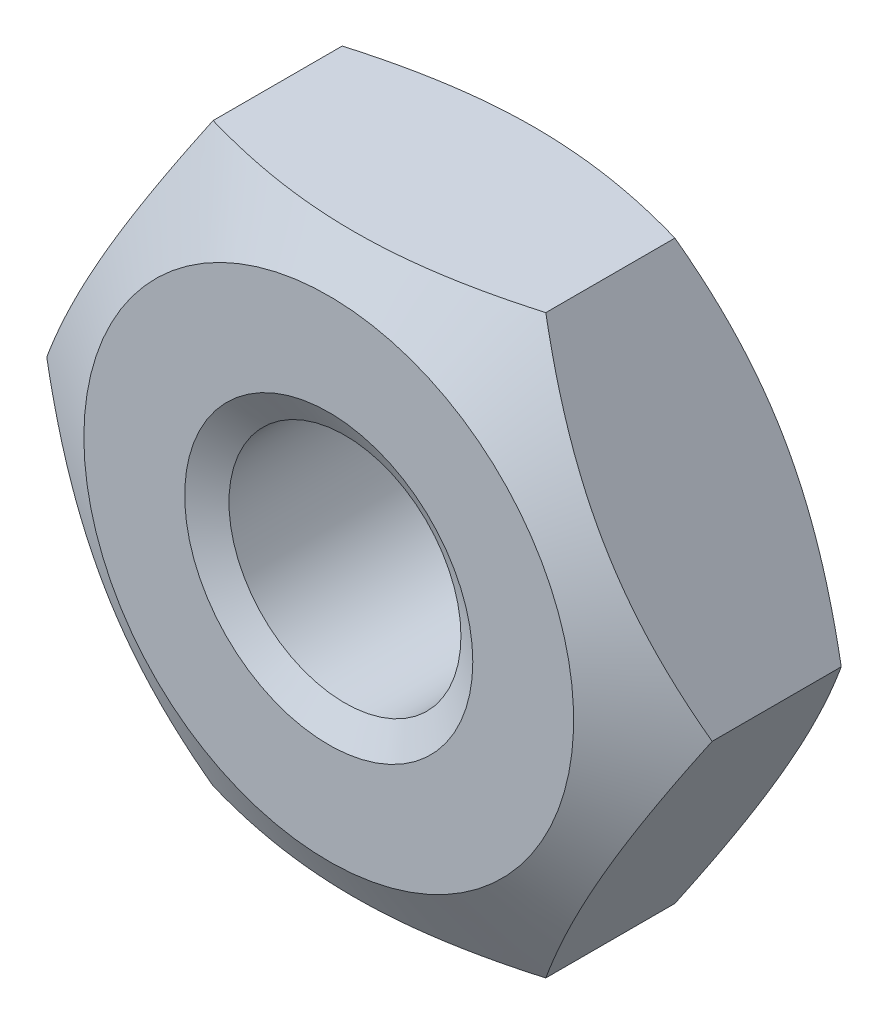
ISO-10303-21;
HEADER;
FILE_DESCRIPTION(('STEP AP214'),'2;1');
FILE_NAME('part.step','',(''),(''),'','','');
FILE_SCHEMA(('AUTOMOTIVE_DESIGN { 1 0 10303 214 1 1 1 1 }'));
ENDSEC;
DATA;
#1=APPLICATION_CONTEXT('core data for automotive mechanical design processes');
#2=APPLICATION_PROTOCOL_DEFINITION('international standard','automotive_design',2000,#1);
#3=PRODUCT_CONTEXT('',#1,'mechanical');
#4=PRODUCT('Part','Part','',(#3));
#5=PRODUCT_RELATED_PRODUCT_CATEGORY('part','',(#4));
#6=PRODUCT_DEFINITION_FORMATION('','',#4);
#7=PRODUCT_DEFINITION_CONTEXT('part definition',#1,'design');
#8=PRODUCT_DEFINITION('design','',#6,#7);
#9=PRODUCT_DEFINITION_SHAPE('','',#8);
#10=(LENGTH_UNIT() NAMED_UNIT(*) SI_UNIT(.MILLI.,.METRE.));
#11=(NAMED_UNIT(*) PLANE_ANGLE_UNIT() SI_UNIT($,.RADIAN.));
#12=(NAMED_UNIT(*) SI_UNIT($,.STERADIAN.) SOLID_ANGLE_UNIT());
#13=UNCERTAINTY_MEASURE_WITH_UNIT(LENGTH_MEASURE(1.E-05),#10,'distance_accuracy_value','');
#14=(GEOMETRIC_REPRESENTATION_CONTEXT(3) GLOBAL_UNCERTAINTY_ASSIGNED_CONTEXT((#13)) GLOBAL_UNIT_ASSIGNED_CONTEXT((#10,
#11,#12)) REPRESENTATION_CONTEXT('',''));
#15=CARTESIAN_POINT('',(0.,0.,0.));
#16=DIRECTION('',(0.,0.,1.));
#17=DIRECTION('',(1.,0.,0.));
#18=AXIS2_PLACEMENT_3D('',#15,#16,#17);
#19=CARTESIAN_POINT('',(1.44337567297406,-2.5,-2.));
#20=DIRECTION('',(0.866025403784439,-0.5,0.));
#21=DIRECTION('',(0.5,0.866025403784439,0.));
#22=AXIS2_PLACEMENT_3D('',#19,#20,#21);
#23=PLANE('',#22);
#24=CARTESIAN_POINT('',(1.44326020292023,-2.5002,-0.439864015305212));
#25=CARTESIAN_POINT('',(1.50668977106845,-2.39033676526513,-0.40322797105373));
#26=CARTESIAN_POINT('',(1.57066685804385,-2.27952520010347,-0.369908569911161));
#27=CARTESIAN_POINT('',(1.69972891130041,-2.05598316653395,-0.311748636503963));
#28=CARTESIAN_POINT('',(1.7648161711947,-1.94324872547161,-0.286928680093844));
#29=CARTESIAN_POINT('',(1.8941840386774,-1.71917700612473,-0.248292002387158));
#30=CARTESIAN_POINT('',(1.95844473900197,-1.60787420823262,-0.234218147131745));
#31=CARTESIAN_POINT('',(2.08726857876804,-1.38474477253167,-0.217415503298857));
#32=CARTESIAN_POINT('',(2.15183124982667,-1.27291894598578,-0.214672802149733));
#33=CARTESIAN_POINT('',(2.27247489412634,-1.06395802444848,-0.22037211095416));
#34=CARTESIAN_POINT('',(2.32857390783979,-0.96679168244227,-0.227414745327968));
#35=CARTESIAN_POINT('',(2.44040644260542,-0.773092050288998,-0.249737770071048));
#36=CARTESIAN_POINT('',(2.49613957671839,-0.676559430340268,-0.265025789386373));
#37=CARTESIAN_POINT('',(2.60820277442169,-0.482460278259524,-0.303245444790525));
#38=CARTESIAN_POINT('',(2.66451865130903,-0.38491831821786,-0.326339127071622));
#39=CARTESIAN_POINT('',(2.77631036402774,-0.191289391923915,-0.378753007524018));
#40=CARTESIAN_POINT('',(2.83178763258718,-0.095199944113824,-0.408060886570653));
#41=CARTESIAN_POINT('',(2.88686681600197,0.000200000000000199,-0.439864015305212));
#42=B_SPLINE_CURVE_WITH_KNOTS('',3,(#24,#25,#26,#27,#28,#29,#30,#31,#32,#33,#34,#35,#36,#37,#38,
#39,#40,#41),.UNSPECIFIED.,.F.,.F.,(4,2,2,2,2,2,2,2,4),(0.,0.396285827362226,0.793524330152049,
1.18093086852114,1.56786160134475,1.90479741793733,2.24204551660463,2.58677531536756,
2.93082800105256),.UNSPECIFIED.);
#43=CARTESIAN_POINT('',(1.44337567297407,-2.5,-0.439797344638706));
#44=VERTEX_POINT('',#43);
#45=CARTESIAN_POINT('',(2.88675134594813,0.,-0.439797344638706));
#46=VERTEX_POINT('',#45);
#47=EDGE_CURVE('E50',#44,#46,#42,.T.);
#48=ORIENTED_EDGE('',*,*,#47,.F.);
#49=DIRECTION('',(0.,0.,1.));
#50=VECTOR('',#49,1.);
#51=CARTESIAN_POINT('',(1.44337567297406,-2.5,-2.));
#52=LINE('',#51,#50);
#53=CARTESIAN_POINT('',(1.44337567297407,-2.5,-1.56020265536129));
#54=VERTEX_POINT('',#53);
#55=EDGE_CURVE('E114',#54,#44,#52,.T.);
#56=ORIENTED_EDGE('',*,*,#55,.F.);
#57=CARTESIAN_POINT('',(2.88686681600197,0.000200000000000212,-1.56013598469479));
#58=CARTESIAN_POINT('',(2.82343724785375,-0.109663234734871,-1.59677202894627));
#59=CARTESIAN_POINT('',(2.75946016087834,-0.220474799896525,-1.63009143008884));
#60=CARTESIAN_POINT('',(2.63039810762178,-0.444016833466049,-1.68825136349604));
#61=CARTESIAN_POINT('',(2.5653108477275,-0.556751274528387,-1.71307131990616));
#62=CARTESIAN_POINT('',(2.43594298024479,-0.780822993875267,-1.75170799761284));
#63=CARTESIAN_POINT('',(2.37168227992023,-0.892125791767375,-1.76578185286825));
#64=CARTESIAN_POINT('',(2.24285844015415,-1.11525522746833,-1.78258449670114));
#65=CARTESIAN_POINT('',(2.17829576909553,-1.22708105401422,-1.78532719785027));
#66=CARTESIAN_POINT('',(2.05765212479586,-1.43604197555152,-1.77962788904584));
#67=CARTESIAN_POINT('',(2.0015531110824,-1.53320831755773,-1.77258525467203));
#68=CARTESIAN_POINT('',(1.88972057631678,-1.726907949711,-1.75026222992895));
#69=CARTESIAN_POINT('',(1.8339874422038,-1.82344056965973,-1.73497421061363));
#70=CARTESIAN_POINT('',(1.7219242445005,-2.01753972174047,-1.69675455520947));
#71=CARTESIAN_POINT('',(1.66560836761316,-2.11508168178214,-1.67366087292838));
#72=CARTESIAN_POINT('',(1.55381665489446,-2.30871060807608,-1.62124699247598));
#73=CARTESIAN_POINT('',(1.49833938633502,-2.40480005588618,-1.59193911342935));
#74=CARTESIAN_POINT('',(1.44326020292023,-2.5002,-1.56013598469479));
#75=B_SPLINE_CURVE_WITH_KNOTS('',3,(#57,#58,#59,#60,#61,#62,#63,#64,#65,#66,#67,#68,#69,#70,#71,
#72,#73,#74),.UNSPECIFIED.,.F.,.F.,(4,2,2,2,2,2,2,2,4),(0.,0.396285827362226,0.793524330152049,
1.18093086852114,1.56786160134475,1.90479741793733,2.24204551660463,2.58677531536756,
2.93082800105256),.UNSPECIFIED.);
#76=CARTESIAN_POINT('',(2.88675134594813,0.,-1.56020265536129));
#77=VERTEX_POINT('',#76);
#78=EDGE_CURVE('E125',#77,#54,#75,.T.);
#79=ORIENTED_EDGE('',*,*,#78,.F.);
#80=DIRECTION('',(0.,0.,1.));
#81=VECTOR('',#80,1.);
#82=CARTESIAN_POINT('',(2.88675134594813,0.,-2.));
#83=LINE('',#82,#81);
#84=EDGE_CURVE('E122',#77,#46,#83,.T.);
#85=ORIENTED_EDGE('',*,*,#84,.T.);
#86=EDGE_LOOP('',(#48,#56,#79,#85));
#87=FACE_BOUND('',#86,.T.);
#88=ADVANCED_FACE('F35',(#87),#23,.T.);
#89=CARTESIAN_POINT('',(-1.44337567297407,-2.5,-2.));
#90=DIRECTION('',(0.,-1.,0.));
#91=DIRECTION('',(1.,0.,0.));
#92=AXIS2_PLACEMENT_3D('',#89,#90,#91);
#93=PLANE('',#92);
#94=CARTESIAN_POINT('',(-3.79809697183274,-2.5,-1.39836340463615));
#95=CARTESIAN_POINT('',(-3.6895339537339,-2.5,-1.3460233279349));
#96=CARTESIAN_POINT('',(-3.58071303413094,-2.5,-1.2942085626323));
#97=CARTESIAN_POINT('',(-3.36241789927729,-2.5,-1.19192685154455));
#98=CARTESIAN_POINT('',(-3.25294357657607,-2.5,-1.1414601353565));
#99=CARTESIAN_POINT('',(-3.03260123964583,-2.5,-1.04190065958588));
#100=CARTESIAN_POINT('',(-2.92172882203492,-2.5,-0.992817610060609));
#101=CARTESIAN_POINT('',(-2.69907388219486,-2.5,-0.896769009617727));
#102=CARTESIAN_POINT('',(-2.58729140580428,-2.5,-0.849803352819128));
#103=CARTESIAN_POINT('',(-2.35936704701194,-2.5,-0.757222473259178));
#104=CARTESIAN_POINT('',(-2.24319290753206,-2.5,-0.711686210769839));
#105=CARTESIAN_POINT('',(-2.00945664254979,-2.5,-0.624255351336021));
#106=CARTESIAN_POINT('',(-1.89189435898976,-2.5,-0.58236117371997));
#107=CARTESIAN_POINT('',(-1.65544162493507,-2.5,-0.503372484437811));
#108=CARTESIAN_POINT('',(-1.5365546994713,-2.5,-0.466267531201229));
#109=CARTESIAN_POINT('',(-1.29707830019273,-2.5,-0.398099507734954));
#110=CARTESIAN_POINT('',(-1.17648940083246,-2.5,-0.367034448850389));
#111=CARTESIAN_POINT('',(-0.934184907386533,-2.5,-0.312645995068943));
#112=CARTESIAN_POINT('',(-0.812478074244643,-2.5,-0.289284310258772));
#113=CARTESIAN_POINT('',(-0.567637702054574,-2.5,-0.251679008924981));
#114=CARTESIAN_POINT('',(-0.444504274199529,-2.5,-0.237434686569658));
#115=CARTESIAN_POINT('',(-0.198999073111887,-2.5,-0.21938754624684));
#116=CARTESIAN_POINT('',(-0.0766369400811742,-2.5,-0.215456778457056));
#117=CARTESIAN_POINT('',(0.167984953007454,-2.5,-0.218037650853715));
#118=CARTESIAN_POINT('',(0.290244708939415,-2.5,-0.224549693379653));
#119=CARTESIAN_POINT('',(0.500221661038462,-2.5,-0.244254251436477));
#120=CARTESIAN_POINT('',(0.588169854326669,-2.5,-0.255110176178535));
#121=CARTESIAN_POINT('',(0.763367144798736,-2.5,-0.281505242472262));
#122=CARTESIAN_POINT('',(0.850616134566707,-2.5,-0.297045089955834));
#123=CARTESIAN_POINT('',(1.11121864583241,-2.5,-0.349869585426673));
#124=CARTESIAN_POINT('',(1.28331937537196,-2.5,-0.393347736223616));
#125=CARTESIAN_POINT('',(1.62762004492218,-2.5,-0.493250663346156));
#126=CARTESIAN_POINT('',(1.7997414848047,-2.5,-0.549935325658462));
#127=CARTESIAN_POINT('',(2.14082903452083,-2.5,-0.67183488396988));
#128=CARTESIAN_POINT('',(2.30979614633856,-2.5,-0.737047016623328));
#129=CARTESIAN_POINT('',(2.58557586173791,-2.5,-0.849132839788063));
#130=CARTESIAN_POINT('',(2.69310481501466,-2.5,-0.894272011085905));
#131=CARTESIAN_POINT('',(2.90731269689309,-2.5,-0.986528009570716));
#132=CARTESIAN_POINT('',(3.01399161162996,-2.5,-1.03364486893709));
#133=CARTESIAN_POINT('',(3.33299945173154,-2.5,-1.17736995724348));
#134=CARTESIAN_POINT('',(3.5442631976473,-2.5,-1.27633762712142));
#135=CARTESIAN_POINT('',(3.96495668212645,-2.5,-1.4785186561316));
#136=CARTESIAN_POINT('',(4.17438465972907,-2.5,-1.58173564422051));
#137=CARTESIAN_POINT('',(4.59179038303276,-2.5,-1.79106913754181));
#138=CARTESIAN_POINT('',(4.79976808624729,-2.5,-1.89718572727534));
#139=CARTESIAN_POINT('',(5.19844052698757,-2.5,-2.1031213530769));
#140=CARTESIAN_POINT('',(5.3892159828471,-2.5,-2.2027846213701));
#141=CARTESIAN_POINT('',(5.77006822329167,-2.5,-2.40344897232332));
#142=CARTESIAN_POINT('',(5.96014498771844,-2.5,-2.50445009320132));
#143=CARTESIAN_POINT('',(6.33934273092011,-2.5,-2.70726185137445));
#144=CARTESIAN_POINT('',(6.52846488441188,-2.5,-2.80907029540534));
#145=CARTESIAN_POINT('',(6.90625874512182,-2.5,-3.01349859050462));
#146=CARTESIAN_POINT('',(7.09493047326484,-2.5,-3.11611840288621));
#147=CARTESIAN_POINT('',(7.28343447776269,-2.5,-3.21904332488198));
#148=B_SPLINE_CURVE_WITH_KNOTS('',3,(#94,#95,#96,#97,#98,#99,#100,#101,#102,#103,#104,#105,#106,
#107,#108,#109,#110,#111,#112,#113,#114,#115,#116,#117,#118,#119,#120,#121,#122,#123,#124,#125,
#126,#127,#128,#129,#130,#131,#132,#133,#134,#135,#136,#137,#138,#139,#140,#141,#142,#143,#144,
#145,#146,#147),.UNSPECIFIED.,.F.,.F.,(4,2,2,2,2,2,2,2,2,2,2,2,2,2,2,2,2,2,2,2,2,2,2,2,2,2,4),
(0.,0.361569083522718,0.723199361127949,1.08693510147565,1.45065263286613,1.82494469185591,
2.19927978773751,2.572784445232,2.94616591606818,3.31766247667463,3.68913027394343,
4.05596736791334,4.42281859568374,4.68853605340165,4.95429357845506,5.48613394464216,
6.02948724785637,6.57266491055424,6.9225045911154,7.27234996620479,7.97215850290565,
8.67257761096566,9.37301715268545,10.0187294138242,10.6644601607465,11.3088098996801,
11.9531290985115),.UNSPECIFIED.);
#149=CARTESIAN_POINT('',(-1.44337567297406,-2.5,-0.439797344638706));
#150=VERTEX_POINT('',#149);
#151=EDGE_CURVE('E107',#150,#44,#148,.T.);
#152=ORIENTED_EDGE('',*,*,#151,.F.);
#153=DIRECTION('',(0.,0.,1.));
#154=VECTOR('',#153,1.);
#155=CARTESIAN_POINT('',(-1.44337567297407,-2.5,-2.));
#156=LINE('',#155,#154);
#157=CARTESIAN_POINT('',(-1.44337567297406,-2.5,-1.56020265536129));
#158=VERTEX_POINT('',#157);
#159=EDGE_CURVE('E106',#158,#150,#156,.T.);
#160=ORIENTED_EDGE('',*,*,#159,.F.);
#161=CARTESIAN_POINT('',(-3.79809697183274,-2.5,-0.601636595363852));
#162=CARTESIAN_POINT('',(-3.6895339537339,-2.5,-0.6539766720651));
#163=CARTESIAN_POINT('',(-3.58071303413094,-2.5,-0.705791437367699));
#164=CARTESIAN_POINT('',(-3.36241789927729,-2.5,-0.808073148455452));
#165=CARTESIAN_POINT('',(-3.25294357657607,-2.5,-0.858539864643498));
#166=CARTESIAN_POINT('',(-3.03260123964583,-2.5,-0.95809934041412));
#167=CARTESIAN_POINT('',(-2.92172882203492,-2.5,-1.00718238993939));
#168=CARTESIAN_POINT('',(-2.69907388219486,-2.5,-1.10323099038227));
#169=CARTESIAN_POINT('',(-2.58729140580428,-2.5,-1.15019664718087));
#170=CARTESIAN_POINT('',(-2.35936704701194,-2.5,-1.24277752674082));
#171=CARTESIAN_POINT('',(-2.24319290753206,-2.5,-1.28831378923016));
#172=CARTESIAN_POINT('',(-2.00945664254979,-2.5,-1.37574464866398));
#173=CARTESIAN_POINT('',(-1.89189435898975,-2.5,-1.41763882628003));
#174=CARTESIAN_POINT('',(-1.65544162493507,-2.5,-1.49662751556219));
#175=CARTESIAN_POINT('',(-1.5365546994713,-2.5,-1.53373246879877));
#176=CARTESIAN_POINT('',(-1.29707830019273,-2.5,-1.60190049226505));
#177=CARTESIAN_POINT('',(-1.17648940083246,-2.5,-1.63296555114961));
#178=CARTESIAN_POINT('',(-0.934184907386532,-2.5,-1.68735400493106));
#179=CARTESIAN_POINT('',(-0.812478074244643,-2.5,-1.71071568974123));
#180=CARTESIAN_POINT('',(-0.567637702054574,-2.5,-1.74832099107502));
#181=CARTESIAN_POINT('',(-0.444504274199529,-2.5,-1.76256531343034));
#182=CARTESIAN_POINT('',(-0.198999073111887,-2.5,-1.78061245375316));
#183=CARTESIAN_POINT('',(-0.0766369400811738,-2.5,-1.78454322154294));
#184=CARTESIAN_POINT('',(0.167984953007454,-2.5,-1.78196234914628));
#185=CARTESIAN_POINT('',(0.290244708939416,-2.5,-1.77545030662035));
#186=CARTESIAN_POINT('',(0.500221661038462,-2.5,-1.75574574856352));
#187=CARTESIAN_POINT('',(0.588169854326669,-2.5,-1.74488982382147));
#188=CARTESIAN_POINT('',(0.763367144798735,-2.5,-1.71849475752774));
#189=CARTESIAN_POINT('',(0.850616134566705,-2.5,-1.70295491004417));
#190=CARTESIAN_POINT('',(1.11121864583241,-2.5,-1.65013041457333));
#191=CARTESIAN_POINT('',(1.28331937537196,-2.5,-1.60665226377638));
#192=CARTESIAN_POINT('',(1.62762004492218,-2.5,-1.50674933665384));
#193=CARTESIAN_POINT('',(1.7997414848047,-2.5,-1.45006467434154));
#194=CARTESIAN_POINT('',(2.14082903452083,-2.5,-1.32816511603012));
#195=CARTESIAN_POINT('',(2.30979614633856,-2.5,-1.26295298337667));
#196=CARTESIAN_POINT('',(2.58557586173791,-2.5,-1.15086716021194));
#197=CARTESIAN_POINT('',(2.69310481501466,-2.5,-1.1057279889141));
#198=CARTESIAN_POINT('',(2.90731269689309,-2.5,-1.01347199042928));
#199=CARTESIAN_POINT('',(3.01399161162996,-2.5,-0.966355131062909));
#200=CARTESIAN_POINT('',(3.33299945173154,-2.5,-0.822630042756516));
#201=CARTESIAN_POINT('',(3.54426319764729,-2.5,-0.723662372878582));
#202=CARTESIAN_POINT('',(3.96495668212645,-2.5,-0.521481343868403));
#203=CARTESIAN_POINT('',(4.17438465972907,-2.5,-0.41826435577949));
#204=CARTESIAN_POINT('',(4.59179038303276,-2.5,-0.208930862458192));
#205=CARTESIAN_POINT('',(4.79976808624728,-2.5,-0.102814272724661));
#206=CARTESIAN_POINT('',(5.19844052698757,-2.5,0.103121353076903));
#207=CARTESIAN_POINT('',(5.38921598284709,-2.5,0.202784621370095));
#208=CARTESIAN_POINT('',(5.77006822329167,-2.5,0.403448972323326));
#209=CARTESIAN_POINT('',(5.96014498771844,-2.5,0.50445009320132));
#210=CARTESIAN_POINT('',(6.3393427309201,-2.5,0.707261851374446));
#211=CARTESIAN_POINT('',(6.52846488441188,-2.5,0.809070295405337));
#212=CARTESIAN_POINT('',(6.90625874512182,-2.5,1.01349859050461));
#213=CARTESIAN_POINT('',(7.09493047326483,-2.5,1.11611840288621));
#214=CARTESIAN_POINT('',(7.28343447776268,-2.5,1.21904332488198));
#215=B_SPLINE_CURVE_WITH_KNOTS('',3,(#161,#162,#163,#164,#165,#166,#167,#168,#169,#170,#171,
#172,#173,#174,#175,#176,#177,#178,#179,#180,#181,#182,#183,#184,#185,#186,#187,#188,#189,#190,
#191,#192,#193,#194,#195,#196,#197,#198,#199,#200,#201,#202,#203,#204,#205,#206,#207,#208,#209,
#210,#211,#212,#213,#214),.UNSPECIFIED.,.F.,.F.,(4,2,2,2,2,2,2,2,2,2,2,2,2,2,2,2,2,2,2,2,2,2,2,
2,2,2,4),(0.,0.361569083522718,0.723199361127949,1.08693510147565,1.45065263286613,
1.82494469185591,2.19927978773752,2.572784445232,2.94616591606819,3.31766247667463,
3.68913027394343,4.05596736791334,4.42281859568374,4.68853605340165,4.95429357845506,
5.48613394464216,6.02948724785636,6.57266491055423,6.9225045911154,7.27234996620479,
7.97215850290565,8.67257761096566,9.37301715268545,10.0187294138242,10.6644601607465,
11.3088098996801,11.9531290985115),.UNSPECIFIED.);
#216=EDGE_CURVE('E196',#54,#158,#215,.F.);
#217=ORIENTED_EDGE('',*,*,#216,.F.);
#218=ORIENTED_EDGE('',*,*,#55,.T.);
#219=EDGE_LOOP('',(#152,#160,#217,#218));
#220=FACE_BOUND('',#219,.T.);
#221=ADVANCED_FACE('F204',(#220),#93,.T.);
#222=CARTESIAN_POINT('',(-2.88675134594813,0.,-2.));
#223=DIRECTION('',(-0.866025403784439,-0.5,0.));
#224=DIRECTION('',(0.5,-0.866025403784439,0.));
#225=AXIS2_PLACEMENT_3D('',#222,#223,#224);
#226=PLANE('',#225);
#227=CARTESIAN_POINT('',(-2.88686681600197,0.000199999999999623,-0.439864015305213));
#228=CARTESIAN_POINT('',(-2.82343724785375,-0.109663234734871,-0.403227971053731));
#229=CARTESIAN_POINT('',(-2.75946016087834,-0.220474799896526,-0.369908569911162));
#230=CARTESIAN_POINT('',(-2.63039810762178,-0.44401683346605,-0.311748636503964));
#231=CARTESIAN_POINT('',(-2.5653108477275,-0.556751274528388,-0.286928680093845));
#232=CARTESIAN_POINT('',(-2.43594298024479,-0.780822993875268,-0.248292002387159));
#233=CARTESIAN_POINT('',(-2.37168227992023,-0.892125791767376,-0.234218147131746));
#234=CARTESIAN_POINT('',(-2.24285844015415,-1.11525522746833,-0.217415503298857));
#235=CARTESIAN_POINT('',(-2.17829576909553,-1.22708105401423,-0.214672802149734));
#236=CARTESIAN_POINT('',(-2.05765212479586,-1.43604197555152,-0.220372110954161));
#237=CARTESIAN_POINT('',(-2.0015531110824,-1.53320831755773,-0.227414745327968));
#238=CARTESIAN_POINT('',(-1.88972057631678,-1.726907949711,-0.249737770071049));
#239=CARTESIAN_POINT('',(-1.8339874422038,-1.82344056965973,-0.265025789386373));
#240=CARTESIAN_POINT('',(-1.7219242445005,-2.01753972174048,-0.303245444790526));
#241=CARTESIAN_POINT('',(-1.66560836761316,-2.11508168178214,-0.326339127071622));
#242=CARTESIAN_POINT('',(-1.55381665489446,-2.30871060807608,-0.378753007524018));
#243=CARTESIAN_POINT('',(-1.49833938633502,-2.40480005588618,-0.408060886570653));
#244=CARTESIAN_POINT('',(-1.44326020292023,-2.5002,-0.439864015305212));
#245=B_SPLINE_CURVE_WITH_KNOTS('',3,(#227,#228,#229,#230,#231,#232,#233,#234,#235,#236,#237,
#238,#239,#240,#241,#242,#243,#244),.UNSPECIFIED.,.F.,.F.,(4,2,2,2,2,2,2,2,4),(0.,
0.396285827362226,0.79352433015205,1.18093086852114,1.56786160134475,1.90479741793733,
2.24204551660463,2.58677531536756,2.93082800105256),.UNSPECIFIED.);
#246=CARTESIAN_POINT('',(-2.88675134594813,0.,-0.439797344638706));
#247=VERTEX_POINT('',#246);
#248=EDGE_CURVE('E90',#247,#150,#245,.T.);
#249=ORIENTED_EDGE('',*,*,#248,.F.);
#250=DIRECTION('',(0.,0.,1.));
#251=VECTOR('',#250,1.);
#252=CARTESIAN_POINT('',(-2.88675134594813,0.,-2.));
#253=LINE('',#252,#251);
#254=CARTESIAN_POINT('',(-2.88675134594813,0.,-1.56020265536129));
#255=VERTEX_POINT('',#254);
#256=EDGE_CURVE('E104',#255,#247,#253,.T.);
#257=ORIENTED_EDGE('',*,*,#256,.F.);
#258=CARTESIAN_POINT('',(-1.44326020292023,-2.5002,-1.56013598469479));
#259=CARTESIAN_POINT('',(-1.50668977106845,-2.39033676526513,-1.59677202894627));
#260=CARTESIAN_POINT('',(-1.57066685804385,-2.27952520010347,-1.63009143008884));
#261=CARTESIAN_POINT('',(-1.69972891130041,-2.05598316653395,-1.68825136349604));
#262=CARTESIAN_POINT('',(-1.7648161711947,-1.94324872547161,-1.71307131990616));
#263=CARTESIAN_POINT('',(-1.8941840386774,-1.71917700612473,-1.75170799761284));
#264=CARTESIAN_POINT('',(-1.95844473900197,-1.60787420823262,-1.76578185286825));
#265=CARTESIAN_POINT('',(-2.08726857876804,-1.38474477253167,-1.78258449670114));
#266=CARTESIAN_POINT('',(-2.15183124982667,-1.27291894598577,-1.78532719785027));
#267=CARTESIAN_POINT('',(-2.27247489412634,-1.06395802444848,-1.77962788904584));
#268=CARTESIAN_POINT('',(-2.32857390783979,-0.96679168244227,-1.77258525467203));
#269=CARTESIAN_POINT('',(-2.44040644260542,-0.773092050288999,-1.75026222992895));
#270=CARTESIAN_POINT('',(-2.4961395767184,-0.676559430340269,-1.73497421061363));
#271=CARTESIAN_POINT('',(-2.60820277442169,-0.482460278259525,-1.69675455520947));
#272=CARTESIAN_POINT('',(-2.66451865130903,-0.38491831821786,-1.67366087292838));
#273=CARTESIAN_POINT('',(-2.77631036402774,-0.191289391923915,-1.62124699247598));
#274=CARTESIAN_POINT('',(-2.83178763258718,-0.0951999441138244,-1.59193911342935));
#275=CARTESIAN_POINT('',(-2.88686681600197,0.000199999999999418,-1.56013598469479));
#276=B_SPLINE_CURVE_WITH_KNOTS('',3,(#258,#259,#260,#261,#262,#263,#264,#265,#266,#267,#268,
#269,#270,#271,#272,#273,#274,#275),.UNSPECIFIED.,.F.,.F.,(4,2,2,2,2,2,2,2,4),(0.,
0.396285827362226,0.793524330152049,1.18093086852114,1.56786160134475,1.90479741793733,
2.24204551660463,2.58677531536756,2.93082800105256),.UNSPECIFIED.);
#277=EDGE_CURVE('E190',#158,#255,#276,.T.);
#278=ORIENTED_EDGE('',*,*,#277,.F.);
#279=ORIENTED_EDGE('',*,*,#159,.T.);
#280=EDGE_LOOP('',(#249,#257,#278,#279));
#281=FACE_BOUND('',#280,.T.);
#282=ADVANCED_FACE('F102',(#281),#226,.T.);
#283=CARTESIAN_POINT('',(-1.44337567297407,2.5,-2.));
#284=DIRECTION('',(-0.866025403784439,0.5,0.));
#285=DIRECTION('',(-0.5,-0.866025403784439,0.));
#286=AXIS2_PLACEMENT_3D('',#283,#284,#285);
#287=PLANE('',#286);
#288=CARTESIAN_POINT('',(-1.44326020292023,2.5002,-0.439864015305213));
#289=CARTESIAN_POINT('',(-1.50668977106845,2.39033676526513,-0.403227971053731));
#290=CARTESIAN_POINT('',(-1.57066685804385,2.27952520010348,-0.369908569911161));
#291=CARTESIAN_POINT('',(-1.69972891130041,2.05598316653395,-0.311748636503964));
#292=CARTESIAN_POINT('',(-1.7648161711947,1.94324872547161,-0.286928680093845));
#293=CARTESIAN_POINT('',(-1.8941840386774,1.71917700612473,-0.248292002387159));
#294=CARTESIAN_POINT('',(-1.95844473900197,1.60787420823262,-0.234218147131746));
#295=CARTESIAN_POINT('',(-2.08726857876804,1.38474477253167,-0.217415503298857));
#296=CARTESIAN_POINT('',(-2.15183124982667,1.27291894598578,-0.214672802149734));
#297=CARTESIAN_POINT('',(-2.27247489412634,1.06395802444848,-0.22037211095416));
#298=CARTESIAN_POINT('',(-2.32857390783979,0.966791682442271,-0.227414745327969));
#299=CARTESIAN_POINT('',(-2.44040644260542,0.773092050288999,-0.249737770071049));
#300=CARTESIAN_POINT('',(-2.4961395767184,0.676559430340268,-0.265025789386373));
#301=CARTESIAN_POINT('',(-2.60820277442169,0.482460278259524,-0.303245444790526));
#302=CARTESIAN_POINT('',(-2.66451865130903,0.38491831821786,-0.326339127071623));
#303=CARTESIAN_POINT('',(-2.77631036402774,0.191289391923915,-0.378753007524018));
#304=CARTESIAN_POINT('',(-2.83178763258718,0.0951999441138238,-0.408060886570653));
#305=CARTESIAN_POINT('',(-2.88686681600197,-0.000200000000000503,-0.439864015305213));
#306=B_SPLINE_CURVE_WITH_KNOTS('',3,(#288,#289,#290,#291,#292,#293,#294,#295,#296,#297,#298,
#299,#300,#301,#302,#303,#304,#305),.UNSPECIFIED.,.F.,.F.,(4,2,2,2,2,2,2,2,4),(0.,
0.396285827362226,0.79352433015205,1.18093086852114,1.56786160134475,1.90479741793733,
2.24204551660463,2.58677531536756,2.93082800105256),.UNSPECIFIED.);
#307=CARTESIAN_POINT('',(-1.44337567297407,2.5,-0.439797344638706));
#308=VERTEX_POINT('',#307);
#309=EDGE_CURVE('E86',#308,#247,#306,.T.);
#310=ORIENTED_EDGE('',*,*,#309,.F.);
#311=DIRECTION('',(0.,0.,1.));
#312=VECTOR('',#311,1.);
#313=CARTESIAN_POINT('',(-1.44337567297407,2.5,-2.));
#314=LINE('',#313,#312);
#315=CARTESIAN_POINT('',(-1.44337567297407,2.5,-1.56020265536129));
#316=VERTEX_POINT('',#315);
#317=EDGE_CURVE('E112',#316,#308,#314,.T.);
#318=ORIENTED_EDGE('',*,*,#317,.F.);
#319=CARTESIAN_POINT('',(-2.88686681600197,-0.00020000000000043,-1.56013598469479));
#320=CARTESIAN_POINT('',(-2.82343724785375,0.109663234734871,-1.59677202894627));
#321=CARTESIAN_POINT('',(-2.75946016087834,0.220474799896525,-1.63009143008884));
#322=CARTESIAN_POINT('',(-2.63039810762178,0.444016833466049,-1.68825136349604));
#323=CARTESIAN_POINT('',(-2.5653108477275,0.556751274528387,-1.71307131990616));
#324=CARTESIAN_POINT('',(-2.43594298024479,0.780822993875268,-1.75170799761284));
#325=CARTESIAN_POINT('',(-2.37168227992023,0.892125791767376,-1.76578185286825));
#326=CARTESIAN_POINT('',(-2.24285844015415,1.11525522746833,-1.78258449670114));
#327=CARTESIAN_POINT('',(-2.17829576909553,1.22708105401423,-1.78532719785027));
#328=CARTESIAN_POINT('',(-2.05765212479586,1.43604197555152,-1.77962788904584));
#329=CARTESIAN_POINT('',(-2.0015531110824,1.53320831755773,-1.77258525467203));
#330=CARTESIAN_POINT('',(-1.88972057631678,1.726907949711,-1.75026222992895));
#331=CARTESIAN_POINT('',(-1.8339874422038,1.82344056965973,-1.73497421061363));
#332=CARTESIAN_POINT('',(-1.7219242445005,2.01753972174048,-1.69675455520947));
#333=CARTESIAN_POINT('',(-1.66560836761316,2.11508168178214,-1.67366087292838));
#334=CARTESIAN_POINT('',(-1.55381665489446,2.30871060807609,-1.62124699247598));
#335=CARTESIAN_POINT('',(-1.49833938633502,2.40480005588618,-1.59193911342935));
#336=CARTESIAN_POINT('',(-1.44326020292023,2.5002,-1.56013598469479));
#337=B_SPLINE_CURVE_WITH_KNOTS('',3,(#319,#320,#321,#322,#323,#324,#325,#326,#327,#328,#329,
#330,#331,#332,#333,#334,#335,#336),.UNSPECIFIED.,.F.,.F.,(4,2,2,2,2,2,2,2,4),(0.,
0.396285827362226,0.79352433015205,1.18093086852114,1.56786160134475,1.90479741793733,
2.24204551660463,2.58677531536756,2.93082800105257),.UNSPECIFIED.);
#338=EDGE_CURVE('E111',#255,#316,#337,.T.);
#339=ORIENTED_EDGE('',*,*,#338,.F.);
#340=ORIENTED_EDGE('',*,*,#256,.T.);
#341=EDGE_LOOP('',(#310,#318,#339,#340));
#342=FACE_BOUND('',#341,.T.);
#343=ADVANCED_FACE('F110',(#342),#287,.T.);
#344=CARTESIAN_POINT('',(1.44337567297406,2.5,-2.));
#345=DIRECTION('',(0.,1.,0.));
#346=DIRECTION('',(0.,0.,1.));
#347=AXIS2_PLACEMENT_3D('',#344,#345,#346);
#348=PLANE('',#347);
#349=CARTESIAN_POINT('',(-3.79809697183274,2.5,-1.39836340463615));
#350=CARTESIAN_POINT('',(-3.6895339537339,2.5,-1.3460233279349));
#351=CARTESIAN_POINT('',(-3.58071303413094,2.5,-1.2942085626323));
#352=CARTESIAN_POINT('',(-3.36241789927729,2.5,-1.19192685154455));
#353=CARTESIAN_POINT('',(-3.25294357657607,2.5,-1.1414601353565));
#354=CARTESIAN_POINT('',(-3.03260123964583,2.5,-1.04190065958588));
#355=CARTESIAN_POINT('',(-2.92172882203492,2.5,-0.99281761006061));
#356=CARTESIAN_POINT('',(-2.69907388219486,2.5,-0.896769009617728));
#357=CARTESIAN_POINT('',(-2.58729140580428,2.5,-0.849803352819128));
#358=CARTESIAN_POINT('',(-2.35936704701194,2.5,-0.757222473259178));
#359=CARTESIAN_POINT('',(-2.24319290753206,2.5,-0.71168621076984));
#360=CARTESIAN_POINT('',(-2.00945664254979,2.5,-0.624255351336022));
#361=CARTESIAN_POINT('',(-1.89189435898976,2.5,-0.58236117371997));
#362=CARTESIAN_POINT('',(-1.65544162493507,2.5,-0.503372484437812));
#363=CARTESIAN_POINT('',(-1.5365546994713,2.5,-0.46626753120123));
#364=CARTESIAN_POINT('',(-1.29707830019273,2.5,-0.398099507734955));
#365=CARTESIAN_POINT('',(-1.17648940083246,2.5,-0.36703444885039));
#366=CARTESIAN_POINT('',(-0.934184907386533,2.5,-0.312645995068943));
#367=CARTESIAN_POINT('',(-0.812478074244643,2.5,-0.289284310258773));
#368=CARTESIAN_POINT('',(-0.567637702054574,2.5,-0.251679008924982));
#369=CARTESIAN_POINT('',(-0.444504274199529,2.5,-0.237434686569658));
#370=CARTESIAN_POINT('',(-0.198999073111886,2.5,-0.219387546246841));
#371=CARTESIAN_POINT('',(-0.0766369400811731,2.5,-0.215456778457057));
#372=CARTESIAN_POINT('',(0.167984953007455,2.5,-0.218037650853716));
#373=CARTESIAN_POINT('',(0.290244708939416,2.5,-0.224549693379654));
#374=CARTESIAN_POINT('',(0.500221661038463,2.5,-0.244254251436477));
#375=CARTESIAN_POINT('',(0.58816985432667,2.5,-0.255110176178535));
#376=CARTESIAN_POINT('',(0.763367144798736,2.5,-0.281505242472262));
#377=CARTESIAN_POINT('',(0.850616134566707,2.5,-0.297045089955835));
#378=CARTESIAN_POINT('',(1.11121864583241,2.5,-0.349869585426673));
#379=CARTESIAN_POINT('',(1.28331937537196,2.5,-0.393347736223616));
#380=CARTESIAN_POINT('',(1.62762004492218,2.5,-0.493250663346157));
#381=CARTESIAN_POINT('',(1.7997414848047,2.5,-0.549935325658463));
#382=CARTESIAN_POINT('',(2.14082903452083,2.5,-0.671834883969881));
#383=CARTESIAN_POINT('',(2.30979614633856,2.5,-0.737047016623329));
#384=CARTESIAN_POINT('',(2.58557586173791,2.5,-0.849132839788064));
#385=CARTESIAN_POINT('',(2.69310481501467,2.5,-0.894272011085906));
#386=CARTESIAN_POINT('',(2.90731269689309,2.5,-0.986528009570717));
#387=CARTESIAN_POINT('',(3.01399161162997,2.5,-1.03364486893709));
#388=CARTESIAN_POINT('',(3.33299945173155,2.5,-1.17736995724349));
#389=CARTESIAN_POINT('',(3.5442631976473,2.5,-1.27633762712142));
#390=CARTESIAN_POINT('',(3.96495668212645,2.5,-1.4785186561316));
#391=CARTESIAN_POINT('',(4.17438465972907,2.5,-1.58173564422051));
#392=CARTESIAN_POINT('',(4.59179038303276,2.5,-1.79106913754181));
#393=CARTESIAN_POINT('',(4.79976808624729,2.5,-1.89718572727534));
#394=CARTESIAN_POINT('',(5.19844052698757,2.5,-2.1031213530769));
#395=CARTESIAN_POINT('',(5.3892159828471,2.5,-2.2027846213701));
#396=CARTESIAN_POINT('',(5.77006822329167,2.5,-2.40344897232333));
#397=CARTESIAN_POINT('',(5.96014498771844,2.5,-2.50445009320132));
#398=CARTESIAN_POINT('',(6.33934273092011,2.5,-2.70726185137445));
#399=CARTESIAN_POINT('',(6.52846488441188,2.5,-2.80907029540534));
#400=CARTESIAN_POINT('',(6.90625874512182,2.5,-3.01349859050461));
#401=CARTESIAN_POINT('',(7.09493047326483,2.5,-3.11611840288621));
#402=CARTESIAN_POINT('',(7.28343447776269,2.5,-3.21904332488198));
#403=B_SPLINE_CURVE_WITH_KNOTS('',3,(#349,#350,#351,#352,#353,#354,#355,#356,#357,#358,#359,
#360,#361,#362,#363,#364,#365,#366,#367,#368,#369,#370,#371,#372,#373,#374,#375,#376,#377,#378,
#379,#380,#381,#382,#383,#384,#385,#386,#387,#388,#389,#390,#391,#392,#393,#394,#395,#396,#397,
#398,#399,#400,#401,#402),.UNSPECIFIED.,.F.,.F.,(4,2,2,2,2,2,2,2,2,2,2,2,2,2,2,2,2,2,2,2,2,2,2,
2,2,2,4),(0.,0.361569083522719,0.72319936112795,1.08693510147565,1.45065263286613,
1.82494469185591,2.19927978773752,2.572784445232,2.94616591606819,3.31766247667463,
3.68913027394343,4.05596736791335,4.42281859568374,4.68853605340165,4.95429357845506,
5.48613394464216,6.02948724785637,6.57266491055424,6.9225045911154,7.27234996620479,
7.97215850290565,8.67257761096566,9.37301715268545,10.0187294138242,10.6644601607465,
11.3088098996801,11.9531290985115),.UNSPECIFIED.);
#404=CARTESIAN_POINT('',(1.44337567297406,2.5,-0.439797344638706));
#405=VERTEX_POINT('',#404);
#406=EDGE_CURVE('E93',#405,#308,#403,.F.);
#407=ORIENTED_EDGE('',*,*,#406,.F.);
#408=DIRECTION('',(0.,0.,1.));
#409=VECTOR('',#408,1.);
#410=CARTESIAN_POINT('',(1.44337567297406,2.5,-2.));
#411=LINE('',#410,#409);
#412=CARTESIAN_POINT('',(1.44337567297406,2.5,-1.56020265536129));
#413=VERTEX_POINT('',#412);
#414=EDGE_CURVE('E116',#413,#405,#411,.T.);
#415=ORIENTED_EDGE('',*,*,#414,.F.);
#416=CARTESIAN_POINT('',(-3.79809697183274,2.5,-0.601636595363852));
#417=CARTESIAN_POINT('',(-3.6895339537339,2.5,-0.6539766720651));
#418=CARTESIAN_POINT('',(-3.58071303413094,2.5,-0.705791437367698));
#419=CARTESIAN_POINT('',(-3.36241789927729,2.5,-0.808073148455452));
#420=CARTESIAN_POINT('',(-3.25294357657607,2.5,-0.858539864643498));
#421=CARTESIAN_POINT('',(-3.03260123964583,2.5,-0.95809934041412));
#422=CARTESIAN_POINT('',(-2.92172882203492,2.5,-1.00718238993939));
#423=CARTESIAN_POINT('',(-2.69907388219486,2.5,-1.10323099038227));
#424=CARTESIAN_POINT('',(-2.58729140580428,2.5,-1.15019664718087));
#425=CARTESIAN_POINT('',(-2.35936704701194,2.5,-1.24277752674082));
#426=CARTESIAN_POINT('',(-2.24319290753206,2.5,-1.28831378923016));
#427=CARTESIAN_POINT('',(-2.00945664254979,2.5,-1.37574464866398));
#428=CARTESIAN_POINT('',(-1.89189435898976,2.5,-1.41763882628003));
#429=CARTESIAN_POINT('',(-1.65544162493507,2.5,-1.49662751556219));
#430=CARTESIAN_POINT('',(-1.5365546994713,2.5,-1.53373246879877));
#431=CARTESIAN_POINT('',(-1.29707830019273,2.5,-1.60190049226504));
#432=CARTESIAN_POINT('',(-1.17648940083246,2.5,-1.63296555114961));
#433=CARTESIAN_POINT('',(-0.934184907386532,2.5,-1.68735400493106));
#434=CARTESIAN_POINT('',(-0.812478074244643,2.5,-1.71071568974123));
#435=CARTESIAN_POINT('',(-0.567637702054574,2.5,-1.74832099107502));
#436=CARTESIAN_POINT('',(-0.444504274199528,2.5,-1.76256531343034));
#437=CARTESIAN_POINT('',(-0.198999073111886,2.5,-1.78061245375316));
#438=CARTESIAN_POINT('',(-0.0766369400811728,2.5,-1.78454322154294));
#439=CARTESIAN_POINT('',(0.167984953007455,2.5,-1.78196234914628));
#440=CARTESIAN_POINT('',(0.290244708939417,2.5,-1.77545030662035));
#441=CARTESIAN_POINT('',(0.500221661038463,2.5,-1.75574574856352));
#442=CARTESIAN_POINT('',(0.58816985432667,2.5,-1.74488982382146));
#443=CARTESIAN_POINT('',(0.763367144798736,2.5,-1.71849475752774));
#444=CARTESIAN_POINT('',(0.850616134566707,2.5,-1.70295491004417));
#445=CARTESIAN_POINT('',(1.11121864583241,2.5,-1.65013041457333));
#446=CARTESIAN_POINT('',(1.28331937537196,2.5,-1.60665226377638));
#447=CARTESIAN_POINT('',(1.62762004492218,2.5,-1.50674933665384));
#448=CARTESIAN_POINT('',(1.7997414848047,2.5,-1.45006467434154));
#449=CARTESIAN_POINT('',(2.14082903452083,2.5,-1.32816511603012));
#450=CARTESIAN_POINT('',(2.30979614633856,2.5,-1.26295298337667));
#451=CARTESIAN_POINT('',(2.58557586173791,2.5,-1.15086716021194));
#452=CARTESIAN_POINT('',(2.69310481501467,2.5,-1.10572798891409));
#453=CARTESIAN_POINT('',(2.90731269689309,2.5,-1.01347199042928));
#454=CARTESIAN_POINT('',(3.01399161162997,2.5,-0.966355131062907));
#455=CARTESIAN_POINT('',(3.33299945173155,2.5,-0.822630042756514));
#456=CARTESIAN_POINT('',(3.5442631976473,2.5,-0.72366237287858));
#457=CARTESIAN_POINT('',(3.96495668212646,2.5,-0.5214813438684));
#458=CARTESIAN_POINT('',(4.17438465972908,2.5,-0.418264355779487));
#459=CARTESIAN_POINT('',(4.59179038303277,2.5,-0.208930862458189));
#460=CARTESIAN_POINT('',(4.79976808624729,2.5,-0.102814272724658));
#461=CARTESIAN_POINT('',(5.19844052698757,2.5,0.103121353076905));
#462=CARTESIAN_POINT('',(5.3892159828471,2.5,0.202784621370097));
#463=CARTESIAN_POINT('',(5.77006822329167,2.5,0.403448972323327));
#464=CARTESIAN_POINT('',(5.96014498771844,2.5,0.50445009320132));
#465=CARTESIAN_POINT('',(6.3393427309201,2.5,0.707261851374446));
#466=CARTESIAN_POINT('',(6.52846488441188,2.5,0.809070295405337));
#467=CARTESIAN_POINT('',(6.90625874512182,2.5,1.01349859050461));
#468=CARTESIAN_POINT('',(7.09493047326483,2.5,1.11611840288621));
#469=CARTESIAN_POINT('',(7.28343447776268,2.5,1.21904332488198));
#470=B_SPLINE_CURVE_WITH_KNOTS('',3,(#416,#417,#418,#419,#420,#421,#422,#423,#424,#425,#426,
#427,#428,#429,#430,#431,#432,#433,#434,#435,#436,#437,#438,#439,#440,#441,#442,#443,#444,#445,
#446,#447,#448,#449,#450,#451,#452,#453,#454,#455,#456,#457,#458,#459,#460,#461,#462,#463,#464,
#465,#466,#467,#468,#469),.UNSPECIFIED.,.F.,.F.,(4,2,2,2,2,2,2,2,2,2,2,2,2,2,2,2,2,2,2,2,2,2,2,
2,2,2,4),(0.,0.361569083522718,0.723199361127949,1.08693510147565,1.45065263286613,
1.82494469185591,2.19927978773751,2.572784445232,2.94616591606819,3.31766247667464,
3.68913027394343,4.05596736791335,4.42281859568374,4.68853605340165,4.95429357845506,
5.48613394464216,6.02948724785637,6.57266491055424,6.9225045911154,7.2723499662048,
7.97215850290565,8.67257761096567,9.37301715268546,10.0187294138242,10.6644601607465,
11.3088098996801,11.9531290985115),.UNSPECIFIED.);
#471=EDGE_CURVE('E58',#316,#413,#470,.T.);
#472=ORIENTED_EDGE('',*,*,#471,.F.);
#473=ORIENTED_EDGE('',*,*,#317,.T.);
#474=EDGE_LOOP('',(#407,#415,#472,#473));
#475=FACE_BOUND('',#474,.T.);
#476=ADVANCED_FACE('F227',(#475),#348,.T.);
#477=CARTESIAN_POINT('',(2.88675134594813,0.,-2.));
#478=DIRECTION('',(0.866025403784438,0.5,0.));
#479=DIRECTION('',(-0.5,0.866025403784438,0.));
#480=AXIS2_PLACEMENT_3D('',#477,#478,#479);
#481=PLANE('',#480);
#482=CARTESIAN_POINT('',(2.88686681600197,-0.000199999999999841,-0.439864015305212));
#483=CARTESIAN_POINT('',(2.82343724785375,0.109663234734871,-0.40322797105373));
#484=CARTESIAN_POINT('',(2.75946016087834,0.220474799896526,-0.369908569911161));
#485=CARTESIAN_POINT('',(2.63039810762178,0.444016833466049,-0.311748636503963));
#486=CARTESIAN_POINT('',(2.5653108477275,0.556751274528387,-0.286928680093844));
#487=CARTESIAN_POINT('',(2.43594298024479,0.780822993875268,-0.248292002387158));
#488=CARTESIAN_POINT('',(2.37168227992023,0.892125791767375,-0.234218147131745));
#489=CARTESIAN_POINT('',(2.24285844015415,1.11525522746833,-0.217415503298856));
#490=CARTESIAN_POINT('',(2.17829576909553,1.22708105401422,-0.214672802149733));
#491=CARTESIAN_POINT('',(2.05765212479586,1.43604197555152,-0.220372110954159));
#492=CARTESIAN_POINT('',(2.0015531110824,1.53320831755773,-0.227414745327967));
#493=CARTESIAN_POINT('',(1.88972057631678,1.726907949711,-0.249737770071048));
#494=CARTESIAN_POINT('',(1.8339874422038,1.82344056965973,-0.265025789386373));
#495=CARTESIAN_POINT('',(1.7219242445005,2.01753972174048,-0.303245444790525));
#496=CARTESIAN_POINT('',(1.66560836761316,2.11508168178214,-0.326339127071622));
#497=CARTESIAN_POINT('',(1.55381665489445,2.30871060807609,-0.378753007524017));
#498=CARTESIAN_POINT('',(1.49833938633502,2.40480005588618,-0.408060886570653));
#499=CARTESIAN_POINT('',(1.44326020292022,2.5002,-0.439864015305212));
#500=B_SPLINE_CURVE_WITH_KNOTS('',3,(#482,#483,#484,#485,#486,#487,#488,#489,#490,#491,#492,
#493,#494,#495,#496,#497,#498,#499),.UNSPECIFIED.,.F.,.F.,(4,2,2,2,2,2,2,2,4),(0.,
0.396285827362226,0.793524330152049,1.18093086852114,1.56786160134475,1.90479741793733,
2.24204551660463,2.58677531536756,2.93082800105256),.UNSPECIFIED.);
#501=EDGE_CURVE('E249',#46,#405,#500,.T.);
#502=ORIENTED_EDGE('',*,*,#501,.F.);
#503=ORIENTED_EDGE('',*,*,#84,.F.);
#504=CARTESIAN_POINT('',(1.44326020292022,2.5002,-1.56013598469479));
#505=CARTESIAN_POINT('',(1.50668977106845,2.39033676526513,-1.59677202894627));
#506=CARTESIAN_POINT('',(1.57066685804385,2.27952520010348,-1.63009143008884));
#507=CARTESIAN_POINT('',(1.69972891130041,2.05598316653395,-1.68825136349604));
#508=CARTESIAN_POINT('',(1.76481617119469,1.94324872547161,-1.71307131990616));
#509=CARTESIAN_POINT('',(1.8941840386774,1.71917700612473,-1.75170799761284));
#510=CARTESIAN_POINT('',(1.95844473900197,1.60787420823263,-1.76578185286825));
#511=CARTESIAN_POINT('',(2.08726857876804,1.38474477253167,-1.78258449670114));
#512=CARTESIAN_POINT('',(2.15183124982667,1.27291894598578,-1.78532719785027));
#513=CARTESIAN_POINT('',(2.27247489412633,1.06395802444848,-1.77962788904584));
#514=CARTESIAN_POINT('',(2.32857390783979,0.966791682442272,-1.77258525467203));
#515=CARTESIAN_POINT('',(2.44040644260541,0.773092050289,-1.75026222992895));
#516=CARTESIAN_POINT('',(2.49613957671839,0.676559430340269,-1.73497421061363));
#517=CARTESIAN_POINT('',(2.60820277442169,0.482460278259525,-1.69675455520947));
#518=CARTESIAN_POINT('',(2.66451865130903,0.384918318217861,-1.67366087292838));
#519=CARTESIAN_POINT('',(2.77631036402774,0.191289391923915,-1.62124699247598));
#520=CARTESIAN_POINT('',(2.83178763258717,0.095199944113824,-1.59193911342935));
#521=CARTESIAN_POINT('',(2.88686681600197,-0.000200000000000135,-1.56013598469479));
#522=B_SPLINE_CURVE_WITH_KNOTS('',3,(#504,#505,#506,#507,#508,#509,#510,#511,#512,#513,#514,
#515,#516,#517,#518,#519,#520,#521),.UNSPECIFIED.,.F.,.F.,(4,2,2,2,2,2,2,2,4),(0.,
0.396285827362226,0.793524330152049,1.18093086852114,1.56786160134475,1.90479741793733,
2.24204551660463,2.58677531536756,2.93082800105256),.UNSPECIFIED.);
#523=EDGE_CURVE('E152',#413,#77,#522,.T.);
#524=ORIENTED_EDGE('',*,*,#523,.F.);
#525=ORIENTED_EDGE('',*,*,#414,.T.);
#526=EDGE_LOOP('',(#502,#503,#524,#525));
#527=FACE_BOUND('',#526,.T.);
#528=ADVANCED_FACE('F146',(#527),#481,.T.);
#529=CARTESIAN_POINT('',(2.88675134594813,0.,-2.));
#530=DIRECTION('',(0.,0.,1.));
#531=DIRECTION('',(1.,0.,0.));
#532=AXIS2_PLACEMENT_3D('',#529,#530,#531);
#533=PLANE('',#532);
#534=CARTESIAN_POINT('',(0.,0.,-2.));
#535=DIRECTION('',(0.,0.,1.));
#536=DIRECTION('',(1.,0.,0.));
#537=AXIS2_PLACEMENT_3D('',#534,#535,#536);
#538=CIRCLE('',#537,1.14708479054767);
#539=CARTESIAN_POINT('',(1.14708479054767,0.,-2.));
#540=VERTEX_POINT('',#539);
#541=EDGE_CURVE('E126',#540,#540,#538,.T.);
#542=ORIENTED_EDGE('',*,*,#541,.T.);
#543=EDGE_LOOP('',(#542));
#544=FACE_BOUND('',#543,.T.);
#545=CARTESIAN_POINT('',(0.,0.,-2.));
#546=DIRECTION('',(0.,0.,-1.));
#547=DIRECTION('',(-1.,0.,0.));
#548=AXIS2_PLACEMENT_3D('',#545,#546,#547);
#549=CIRCLE('',#548,2.125);
#550=CARTESIAN_POINT('',(-2.125,0.,-2.));
#551=VERTEX_POINT('',#550);
#552=EDGE_CURVE('E150',#551,#551,#549,.T.);
#553=ORIENTED_EDGE('',*,*,#552,.T.);
#554=EDGE_LOOP('',(#553));
#555=FACE_BOUND('',#554,.T.);
#556=ADVANCED_FACE('F142',(#544,#555),#533,.F.);
#557=CARTESIAN_POINT('',(2.88675134594813,0.,0.));
#558=DIRECTION('',(0.,0.,1.));
#559=DIRECTION('',(1.,0.,0.));
#560=AXIS2_PLACEMENT_3D('',#557,#558,#559);
#561=PLANE('',#560);
#562=CARTESIAN_POINT('',(0.,0.,0.));
#563=DIRECTION('',(0.,0.,1.));
#564=DIRECTION('',(1.,0.,0.));
#565=AXIS2_PLACEMENT_3D('',#562,#563,#564);
#566=CIRCLE('',#565,1.25);
#567=CARTESIAN_POINT('',(1.25,0.,0.));
#568=VERTEX_POINT('',#567);
#569=EDGE_CURVE('E11',#568,#568,#566,.F.);
#570=ORIENTED_EDGE('',*,*,#569,.T.);
#571=EDGE_LOOP('',(#570));
#572=FACE_BOUND('',#571,.T.);
#573=CARTESIAN_POINT('',(0.,0.,0.));
#574=DIRECTION('',(0.,0.,-1.));
#575=DIRECTION('',(-1.,0.,0.));
#576=AXIS2_PLACEMENT_3D('',#573,#574,#575);
#577=CIRCLE('',#576,2.125);
#578=CARTESIAN_POINT('',(-2.125,0.,0.));
#579=VERTEX_POINT('',#578);
#580=EDGE_CURVE('E250',#579,#579,#577,.T.);
#581=ORIENTED_EDGE('',*,*,#580,.F.);
#582=EDGE_LOOP('',(#581));
#583=FACE_BOUND('',#582,.T.);
#584=ADVANCED_FACE('F145',(#572,#583),#561,.T.);
#585=CARTESIAN_POINT('',(0.,0.,-2.));
#586=DIRECTION('',(0.,0.,1.));
#587=DIRECTION('',(1.,0.,0.));
#588=AXIS2_PLACEMENT_3D('',#585,#586,#587);
#589=CYLINDRICAL_SURFACE('',#588,1.0065);
#590=CARTESIAN_POINT('',(0.,0.,-1.7565));
#591=DIRECTION('',(0.,0.,1.));
#592=DIRECTION('',(1.,0.,0.));
#593=AXIS2_PLACEMENT_3D('',#590,#591,#592);
#594=CIRCLE('',#593,1.0065);
#595=CARTESIAN_POINT('',(1.0065,0.,-1.7565));
#596=VERTEX_POINT('',#595);
#597=EDGE_CURVE('E43',#596,#596,#594,.F.);
#598=ORIENTED_EDGE('',*,*,#597,.T.);
#599=EDGE_LOOP('',(#598));
#600=FACE_BOUND('',#599,.T.);
#601=CARTESIAN_POINT('',(0.,0.,-0.140584790547673));
#602=DIRECTION('',(0.,0.,1.));
#603=DIRECTION('',(1.,0.,0.));
#604=AXIS2_PLACEMENT_3D('',#601,#602,#603);
#605=CIRCLE('',#604,1.0065);
#606=CARTESIAN_POINT('',(1.0065,0.,-0.140584790547673));
#607=VERTEX_POINT('',#606);
#608=EDGE_CURVE('E129',#607,#607,#605,.T.);
#609=ORIENTED_EDGE('',*,*,#608,.T.);
#610=EDGE_LOOP('',(#609));
#611=FACE_BOUND('',#610,.T.);
#612=ADVANCED_FACE('F134',(#600,#611),#589,.F.);
#613=CARTESIAN_POINT('',(0.,0.,-1.56020265536129));
#614=DIRECTION('',(0.,0.,1.));
#615=DIRECTION('',(1.,0.,0.));
#616=AXIS2_PLACEMENT_3D('',#613,#614,#615);
#617=CONICAL_SURFACE('',#616,2.88675134594813,1.0471975511966);
#618=ORIENTED_EDGE('',*,*,#78,.T.);
#619=ORIENTED_EDGE('',*,*,#216,.T.);
#620=ORIENTED_EDGE('',*,*,#277,.T.);
#621=ORIENTED_EDGE('',*,*,#338,.T.);
#622=ORIENTED_EDGE('',*,*,#471,.T.);
#623=ORIENTED_EDGE('',*,*,#523,.T.);
#624=EDGE_LOOP('',(#618,#619,#620,#621,#622,#623));
#625=FACE_BOUND('',#624,.T.);
#626=ORIENTED_EDGE('',*,*,#552,.F.);
#627=EDGE_LOOP('',(#626));
#628=FACE_BOUND('',#627,.T.);
#629=ADVANCED_FACE('F174',(#625,#628),#617,.T.);
#630=CARTESIAN_POINT('',(0.,0.,0.));
#631=DIRECTION('',(0.,0.,-1.));
#632=DIRECTION('',(-1.,0.,0.));
#633=AXIS2_PLACEMENT_3D('',#630,#631,#632);
#634=CONICAL_SURFACE('',#633,2.125,1.0471975511966);
#635=ORIENTED_EDGE('',*,*,#47,.T.);
#636=ORIENTED_EDGE('',*,*,#501,.T.);
#637=ORIENTED_EDGE('',*,*,#406,.T.);
#638=ORIENTED_EDGE('',*,*,#309,.T.);
#639=ORIENTED_EDGE('',*,*,#248,.T.);
#640=ORIENTED_EDGE('',*,*,#151,.T.);
#641=EDGE_LOOP('',(#635,#636,#637,#638,#639,#640));
#642=FACE_BOUND('',#641,.T.);
#643=ORIENTED_EDGE('',*,*,#580,.T.);
#644=EDGE_LOOP('',(#643));
#645=FACE_BOUND('',#644,.T.);
#646=ADVANCED_FACE('F88',(#642,#645),#634,.T.);
#647=CARTESIAN_POINT('',(0.,0.,-2.));
#648=DIRECTION('',(0.,0.,-1.));
#649=DIRECTION('',(-1.,0.,0.));
#650=AXIS2_PLACEMENT_3D('',#647,#648,#649);
#651=CONICAL_SURFACE('',#650,1.14708479054767,0.523598775598297);
#652=ORIENTED_EDGE('',*,*,#597,.F.);
#653=EDGE_LOOP('',(#652));
#654=FACE_BOUND('',#653,.T.);
#655=ORIENTED_EDGE('',*,*,#541,.F.);
#656=EDGE_LOOP('',(#655));
#657=FACE_BOUND('',#656,.T.);
#658=ADVANCED_FACE('F137',(#654,#657),#651,.F.);
#659=CARTESIAN_POINT('',(0.,0.,-0.140584790547673));
#660=DIRECTION('',(0.,0.,1.));
#661=DIRECTION('',(1.,0.,0.));
#662=AXIS2_PLACEMENT_3D('',#659,#660,#661);
#663=CONICAL_SURFACE('',#662,1.0065,1.0471975511966);
#664=ORIENTED_EDGE('',*,*,#569,.F.);
#665=EDGE_LOOP('',(#664));
#666=FACE_BOUND('',#665,.T.);
#667=ORIENTED_EDGE('',*,*,#608,.F.);
#668=EDGE_LOOP('',(#667));
#669=FACE_BOUND('',#668,.T.);
#670=ADVANCED_FACE('F37',(#666,#669),#663,.F.);
#671=CLOSED_SHELL('',(#88,#221,#282,#343,#476,#528,#556,#584,#612,#629,#646,#658,#670));
#672=MANIFOLD_SOLID_BREP('B2',#671);
#673=ADVANCED_BREP_SHAPE_REPRESENTATION('',(#18,#672),#14);
#674=SHAPE_DEFINITION_REPRESENTATION(#9,#673);
ENDSEC;
END-ISO-10303-21;
